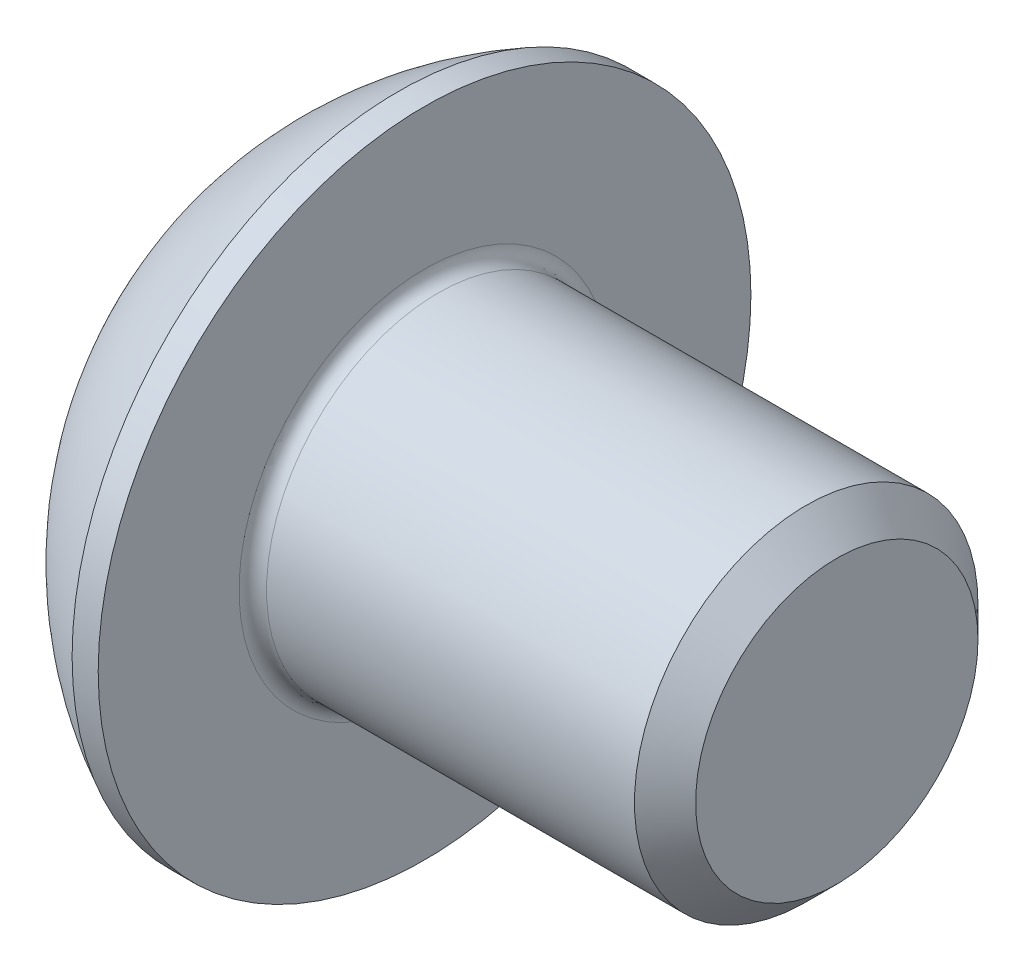
ISO-10303-21;
HEADER;
FILE_DESCRIPTION(('STEP AP214'),'2;1');
FILE_NAME('part.step','',(''),(''),'','','');
FILE_SCHEMA(('AUTOMOTIVE_DESIGN { 1 0 10303 214 1 1 1 1 }'));
ENDSEC;
DATA;
#1=APPLICATION_CONTEXT('core data for automotive mechanical design processes');
#2=APPLICATION_PROTOCOL_DEFINITION('international standard','automotive_design',2000,#1);
#3=PRODUCT_CONTEXT('',#1,'mechanical');
#4=PRODUCT('Part','Part','',(#3));
#5=PRODUCT_RELATED_PRODUCT_CATEGORY('part','',(#4));
#6=PRODUCT_DEFINITION_FORMATION('','',#4);
#7=PRODUCT_DEFINITION_CONTEXT('part definition',#1,'design');
#8=PRODUCT_DEFINITION('design','',#6,#7);
#9=PRODUCT_DEFINITION_SHAPE('','',#8);
#10=(LENGTH_UNIT() NAMED_UNIT(*) SI_UNIT(.MILLI.,.METRE.));
#11=(NAMED_UNIT(*) PLANE_ANGLE_UNIT() SI_UNIT($,.RADIAN.));
#12=(NAMED_UNIT(*) SI_UNIT($,.STERADIAN.) SOLID_ANGLE_UNIT());
#13=UNCERTAINTY_MEASURE_WITH_UNIT(LENGTH_MEASURE(1.E-05),#10,'distance_accuracy_value','');
#14=(GEOMETRIC_REPRESENTATION_CONTEXT(3) GLOBAL_UNCERTAINTY_ASSIGNED_CONTEXT((#13)) GLOBAL_UNIT_ASSIGNED_CONTEXT((#10,
#11,#12)) REPRESENTATION_CONTEXT('',''));
#15=CARTESIAN_POINT('',(0.,0.,0.));
#16=DIRECTION('',(0.,0.,1.));
#17=DIRECTION('',(1.,0.,0.));
#18=AXIS2_PLACEMENT_3D('',#15,#16,#17);
#19=CARTESIAN_POINT('',(4.75485015536767,-1.38777878078145E-13,-4.44089209850063E-13));
#20=DIRECTION('',(1.,0.,0.));
#21=DIRECTION('',(0.,0.999999999999994,0.));
#22=AXIS2_PLACEMENT_3D('',#19,#20,#21);
#23=SPHERICAL_SURFACE('',#22,5.315);
#24=CARTESIAN_POINT('',(0.,0.,0.));
#25=DIRECTION('',(1.,0.,0.));
#26=DIRECTION('',(0.,0.,-1.));
#27=AXIS2_PLACEMENT_3D('',#24,#25,#26);
#28=CIRCLE('',#27,2.375);
#29=CARTESIAN_POINT('',(0.,0.,-2.375));
#30=VERTEX_POINT('',#29);
#31=EDGE_CURVE('E190',#30,#30,#28,.T.);
#32=ORIENTED_EDGE('',*,*,#31,.T.);
#33=EDGE_LOOP('',(#32));
#34=FACE_BOUND('',#33,.T.);
#35=CARTESIAN_POINT('',(2.37016464151056,0.,0.));
#36=DIRECTION('',(1.,0.,0.));
#37=DIRECTION('',(0.,0.,-1.));
#38=AXIS2_PLACEMENT_3D('',#35,#36,#37);
#39=CIRCLE('',#38,4.75);
#40=CARTESIAN_POINT('',(2.37016464151061,0.,-4.75));
#41=VERTEX_POINT('',#40);
#42=EDGE_CURVE('E177',#41,#41,#39,.T.);
#43=ORIENTED_EDGE('',*,*,#42,.F.);
#44=EDGE_LOOP('',(#43));
#45=FACE_BOUND('',#44,.T.);
#46=ADVANCED_FACE('F34',(#34,#45),#23,.T.);
#47=CARTESIAN_POINT('',(-1.38777878078145E-13,2.37500000000004,-1.11022302462516E-13));
#48=DIRECTION('',(-1.,0.,0.));
#49=DIRECTION('',(0.,0.,1.));
#50=AXIS2_PLACEMENT_3D('',#47,#48,#49);
#51=PLANE('',#50);
#52=DIRECTION('',(0.,0.499999999999997,-0.86602540378444));
#53=VECTOR('',#52,1.);
#54=CARTESIAN_POINT('',(4.85722573273506E-13,0.866025403784443,1.5));
#55=LINE('',#54,#53);
#56=CARTESIAN_POINT('',(4.85722573273506E-13,0.866025403784443,1.5));
#57=VERTEX_POINT('',#56);
#58=CARTESIAN_POINT('',(-4.85722573273506E-13,1.73205080756889,0.));
#59=VERTEX_POINT('',#58);
#60=EDGE_CURVE('E156',#57,#59,#55,.T.);
#61=ORIENTED_EDGE('',*,*,#60,.F.);
#62=DIRECTION('',(0.,0.999999999999995,0.));
#63=VECTOR('',#62,1.);
#64=CARTESIAN_POINT('',(0.,-0.866025403784387,1.49999999999995));
#65=LINE('',#64,#63);
#66=CARTESIAN_POINT('',(0.,-0.866025403784387,1.49999999999995));
#67=VERTEX_POINT('',#66);
#68=EDGE_CURVE('E153',#67,#57,#65,.T.);
#69=ORIENTED_EDGE('',*,*,#68,.F.);
#70=DIRECTION('',(0.,0.499999999999998,0.866025403784441));
#71=VECTOR('',#70,1.);
#72=CARTESIAN_POINT('',(3.46944695195361E-13,-1.73205080756877,-2.22044604925031E-13));
#73=LINE('',#72,#71);
#74=CARTESIAN_POINT('',(3.46944695195361E-13,-1.73205080756877,-2.22044604925031E-13));
#75=VERTEX_POINT('',#74);
#76=EDGE_CURVE('E151',#75,#67,#73,.T.);
#77=ORIENTED_EDGE('',*,*,#76,.F.);
#78=DIRECTION('',(0.,-0.499999999999997,0.86602540378444));
#79=VECTOR('',#78,1.);
#80=CARTESIAN_POINT('',(0.,-0.866025403784415,-1.5));
#81=LINE('',#80,#79);
#82=CARTESIAN_POINT('',(0.,-0.866025403784415,-1.5));
#83=VERTEX_POINT('',#82);
#84=EDGE_CURVE('E149',#83,#75,#81,.T.);
#85=ORIENTED_EDGE('',*,*,#84,.F.);
#86=DIRECTION('',(0.,-0.999999999999994,0.));
#87=VECTOR('',#86,1.);
#88=CARTESIAN_POINT('',(0.,0.866025403784387,-1.49999999999995));
#89=LINE('',#88,#87);
#90=CARTESIAN_POINT('',(0.,0.866025403784387,-1.49999999999995));
#91=VERTEX_POINT('',#90);
#92=EDGE_CURVE('E123',#91,#83,#89,.T.);
#93=ORIENTED_EDGE('',*,*,#92,.F.);
#94=DIRECTION('',(0.,-0.499999999999997,-0.866025403784442));
#95=VECTOR('',#94,1.);
#96=CARTESIAN_POINT('',(-4.85722573273506E-13,1.73205080756889,0.));
#97=LINE('',#96,#95);
#98=EDGE_CURVE('E116',#59,#91,#97,.T.);
#99=ORIENTED_EDGE('',*,*,#98,.F.);
#100=EDGE_LOOP('',(#61,#69,#77,#85,#93,#99));
#101=FACE_BOUND('',#100,.T.);
#102=ORIENTED_EDGE('',*,*,#31,.F.);
#103=EDGE_LOOP('',(#102));
#104=FACE_BOUND('',#103,.T.);
#105=ADVANCED_FACE('F212',(#101,#104),#51,.T.);
#106=CARTESIAN_POINT('',(8.74999999999999,-4.9960036108132E-13,-1.16573417585641E-12));
#107=DIRECTION('',(1.,0.,0.));
#108=DIRECTION('',(0.,0.,-1.));
#109=AXIS2_PLACEMENT_3D('',#106,#107,#108);
#110=PLANE('',#109);
#111=CARTESIAN_POINT('',(8.74999999999999,-4.9960036108132E-13,-1.16573417585641E-12));
#112=DIRECTION('',(1.,0.,0.));
#113=DIRECTION('',(0.,0.,-1.));
#114=AXIS2_PLACEMENT_3D('',#111,#112,#113);
#115=CIRCLE('',#114,2.055);
#116=CARTESIAN_POINT('',(8.75000000000001,-4.99714436497101E-13,-2.05500000000117));
#117=VERTEX_POINT('',#116);
#118=EDGE_CURVE('E187',#117,#117,#115,.T.);
#119=ORIENTED_EDGE('',*,*,#118,.T.);
#120=EDGE_LOOP('',(#119));
#121=FACE_BOUND('',#120,.T.);
#122=ADVANCED_FACE('F217',(#121),#110,.T.);
#123=CARTESIAN_POINT('',(8.74999999999999,-4.9960036108132E-13,-1.16573417585641E-12));
#124=DIRECTION('',(-1.,0.,0.));
#125=DIRECTION('',(0.,0.,1.));
#126=AXIS2_PLACEMENT_3D('',#123,#124,#125);
#127=CONICAL_SURFACE('',#126,2.055,0.785398163397436);
#128=CARTESIAN_POINT('',(8.30499999999998,-1.11022302462516E-13,0.));
#129=DIRECTION('',(1.,0.,0.));
#130=DIRECTION('',(0.,0.,-1.));
#131=AXIS2_PLACEMENT_3D('',#128,#129,#130);
#132=CIRCLE('',#131,2.5);
#133=CARTESIAN_POINT('',(8.305,-1.11161080340594E-13,-2.5));
#134=VERTEX_POINT('',#133);
#135=EDGE_CURVE('E184',#134,#134,#132,.T.);
#136=ORIENTED_EDGE('',*,*,#135,.T.);
#137=EDGE_LOOP('',(#136));
#138=FACE_BOUND('',#137,.T.);
#139=ORIENTED_EDGE('',*,*,#118,.F.);
#140=EDGE_LOOP('',(#139));
#141=FACE_BOUND('',#140,.T.);
#142=ADVANCED_FACE('F224',(#138,#141),#127,.T.);
#143=CARTESIAN_POINT('',(-3.64348996551984,0.,-1.66533453693773E-13));
#144=DIRECTION('',(1.,0.,0.));
#145=DIRECTION('',(0.,0.,-1.));
#146=AXIS2_PLACEMENT_3D('',#143,#144,#145);
#147=CYLINDRICAL_SURFACE('',#146,2.5);
#148=CARTESIAN_POINT('',(2.94999999999999,0.,0.));
#149=DIRECTION('',(1.,0.,0.));
#150=DIRECTION('',(0.,0.,-1.));
#151=AXIS2_PLACEMENT_3D('',#148,#149,#150);
#152=CIRCLE('',#151,2.5);
#153=CARTESIAN_POINT('',(2.95000000000002,0.,-2.50000000000006));
#154=VERTEX_POINT('',#153);
#155=EDGE_CURVE('E42',#154,#154,#152,.T.);
#156=ORIENTED_EDGE('',*,*,#155,.T.);
#157=EDGE_LOOP('',(#156));
#158=FACE_BOUND('',#157,.T.);
#159=ORIENTED_EDGE('',*,*,#135,.F.);
#160=EDGE_LOOP('',(#159));
#161=FACE_BOUND('',#160,.T.);
#162=ADVANCED_FACE('F195',(#158,#161),#147,.T.);
#163=CARTESIAN_POINT('',(2.74999999999986,2.49999999999989,-2.22044604925031E-13));
#164=DIRECTION('',(1.,0.,0.));
#165=DIRECTION('',(0.,0.,-1.));
#166=AXIS2_PLACEMENT_3D('',#163,#164,#165);
#167=PLANE('',#166);
#168=CARTESIAN_POINT('',(2.75,0.,0.));
#169=DIRECTION('',(1.,0.,0.));
#170=DIRECTION('',(0.,0.,-1.));
#171=AXIS2_PLACEMENT_3D('',#168,#169,#170);
#172=CIRCLE('',#171,2.7);
#173=CARTESIAN_POINT('',(2.75000000000003,0.,-2.7));
#174=VERTEX_POINT('',#173);
#175=EDGE_CURVE('E11',#174,#174,#172,.F.);
#176=ORIENTED_EDGE('',*,*,#175,.T.);
#177=EDGE_LOOP('',(#176));
#178=FACE_BOUND('',#177,.T.);
#179=CARTESIAN_POINT('',(2.75,0.,0.));
#180=DIRECTION('',(1.,0.,0.));
#181=DIRECTION('',(0.,0.,-1.));
#182=AXIS2_PLACEMENT_3D('',#179,#180,#181);
#183=CIRCLE('',#182,4.75);
#184=CARTESIAN_POINT('',(2.75000000000005,0.,-4.75));
#185=VERTEX_POINT('',#184);
#186=EDGE_CURVE('E181',#185,#185,#183,.T.);
#187=ORIENTED_EDGE('',*,*,#186,.T.);
#188=EDGE_LOOP('',(#187));
#189=FACE_BOUND('',#188,.T.);
#190=ADVANCED_FACE('F207',(#178,#189),#167,.T.);
#191=CARTESIAN_POINT('',(-3.64348996551984,0.,-1.66533453693773E-13));
#192=DIRECTION('',(1.,0.,0.));
#193=DIRECTION('',(0.,0.,-1.));
#194=AXIS2_PLACEMENT_3D('',#191,#192,#193);
#195=CYLINDRICAL_SURFACE('',#194,4.75);
#196=ORIENTED_EDGE('',*,*,#42,.T.);
#197=EDGE_LOOP('',(#196));
#198=FACE_BOUND('',#197,.T.);
#199=ORIENTED_EDGE('',*,*,#186,.F.);
#200=EDGE_LOOP('',(#199));
#201=FACE_BOUND('',#200,.T.);
#202=ADVANCED_FACE('F199',(#198,#201),#195,.T.);
#203=CARTESIAN_POINT('',(2.94999999999999,0.,0.));
#204=DIRECTION('',(1.,0.,0.));
#205=DIRECTION('',(0.,0.,-1.));
#206=AXIS2_PLACEMENT_3D('',#203,#204,#205);
#207=TOROIDAL_SURFACE('',#206,2.7,0.2);
#208=ORIENTED_EDGE('',*,*,#175,.F.);
#209=EDGE_LOOP('',(#208));
#210=FACE_BOUND('',#209,.T.);
#211=ORIENTED_EDGE('',*,*,#155,.F.);
#212=EDGE_LOOP('',(#211));
#213=FACE_BOUND('',#212,.T.);
#214=ADVANCED_FACE('F36',(#210,#213),#207,.F.);
#215=CARTESIAN_POINT('',(1.55999999999999,0.866025403784387,-1.50000000000022));
#216=DIRECTION('',(0.,0.,-1.));
#217=DIRECTION('',(-1.,0.,0.));
#218=AXIS2_PLACEMENT_3D('',#215,#216,#217);
#219=PLANE('',#218);
#220=DIRECTION('',(0.,-0.999999999999994,0.));
#221=VECTOR('',#220,1.);
#222=CARTESIAN_POINT('',(1.55999999999999,0.866025403784387,-1.50000000000022));
#223=LINE('',#222,#221);
#224=CARTESIAN_POINT('',(1.55999999999999,0.866025403784387,-1.50000000000022));
#225=VERTEX_POINT('',#224);
#226=CARTESIAN_POINT('',(1.55999999999999,-1.94289029309402E-13,-1.50000000000045));
#227=VERTEX_POINT('',#226);
#228=EDGE_CURVE('E115',#225,#227,#223,.T.);
#229=ORIENTED_EDGE('',*,*,#228,.F.);
#230=DIRECTION('',(-1.,0.,0.));
#231=VECTOR('',#230,1.);
#232=CARTESIAN_POINT('',(1.55999999999999,0.866025403784387,-1.50000000000022));
#233=LINE('',#232,#231);
#234=EDGE_CURVE('E161',#225,#91,#233,.T.);
#235=ORIENTED_EDGE('',*,*,#234,.T.);
#236=ORIENTED_EDGE('',*,*,#92,.T.);
#237=DIRECTION('',(-1.,0.,0.));
#238=VECTOR('',#237,1.);
#239=CARTESIAN_POINT('',(1.56000000000001,-0.866025403784859,-1.50000000000095));
#240=LINE('',#239,#238);
#241=CARTESIAN_POINT('',(1.56000000000001,-0.866025403784859,-1.50000000000095));
#242=VERTEX_POINT('',#241);
#243=EDGE_CURVE('E120',#242,#83,#240,.T.);
#244=ORIENTED_EDGE('',*,*,#243,.F.);
#245=EDGE_CURVE('E105',#227,#242,#223,.T.);
#246=ORIENTED_EDGE('',*,*,#245,.F.);
#247=EDGE_LOOP('',(#229,#235,#236,#244,#246));
#248=FACE_BOUND('',#247,.T.);
#249=ADVANCED_FACE('F121',(#248),#219,.F.);
#250=CARTESIAN_POINT('',(1.55999999999952,1.73205080756869,-3.88578058618805E-13));
#251=DIRECTION('',(0.,0.866025403784435,-0.500000000000001));
#252=DIRECTION('',(0.,0.499999999999997,0.866025403784442));
#253=AXIS2_PLACEMENT_3D('',#250,#251,#252);
#254=PLANE('',#253);
#255=DIRECTION('',(0.,-0.499999999999997,-0.866025403784442));
#256=VECTOR('',#255,1.);
#257=CARTESIAN_POINT('',(1.55999999999952,1.73205080756869,-3.88578058618805E-13));
#258=LINE('',#257,#256);
#259=CARTESIAN_POINT('',(1.55999999999952,1.73205080756869,-3.88578058618805E-13));
#260=VERTEX_POINT('',#259);
#261=CARTESIAN_POINT('',(1.55999999999987,1.29903810567616,-0.750000000000806));
#262=VERTEX_POINT('',#261);
#263=EDGE_CURVE('E127',#260,#262,#258,.T.);
#264=ORIENTED_EDGE('',*,*,#263,.F.);
#265=DIRECTION('',(-1.,0.,0.));
#266=VECTOR('',#265,1.);
#267=CARTESIAN_POINT('',(1.55999999999952,1.73205080756869,-3.88578058618805E-13));
#268=LINE('',#267,#266);
#269=EDGE_CURVE('E164',#260,#59,#268,.T.);
#270=ORIENTED_EDGE('',*,*,#269,.T.);
#271=ORIENTED_EDGE('',*,*,#98,.T.);
#272=ORIENTED_EDGE('',*,*,#234,.F.);
#273=EDGE_CURVE('E145',#262,#225,#258,.T.);
#274=ORIENTED_EDGE('',*,*,#273,.F.);
#275=EDGE_LOOP('',(#264,#270,#271,#272,#274));
#276=FACE_BOUND('',#275,.T.);
#277=ADVANCED_FACE('F205',(#276),#254,.F.);
#278=CARTESIAN_POINT('',(1.56000000000048,0.866025403783804,1.49999999999878));
#279=DIRECTION('',(0.,0.866025403784434,0.500000000000002));
#280=DIRECTION('',(0.,-0.499999999999997,0.866025403784441));
#281=AXIS2_PLACEMENT_3D('',#278,#279,#280);
#282=PLANE('',#281);
#283=DIRECTION('',(0.,0.499999999999997,-0.86602540378444));
#284=VECTOR('',#283,1.);
#285=CARTESIAN_POINT('',(1.56000000000048,0.866025403783804,1.49999999999878));
#286=LINE('',#285,#284);
#287=CARTESIAN_POINT('',(1.56000000000048,0.866025403783804,1.49999999999878));
#288=VERTEX_POINT('',#287);
#289=CARTESIAN_POINT('',(1.56000000000034,1.29903810567647,0.749999999999695));
#290=VERTEX_POINT('',#289);
#291=EDGE_CURVE('E49',#288,#290,#286,.T.);
#292=ORIENTED_EDGE('',*,*,#291,.F.);
#293=DIRECTION('',(-1.,0.,0.));
#294=VECTOR('',#293,1.);
#295=CARTESIAN_POINT('',(1.56000000000048,0.866025403783804,1.49999999999878));
#296=LINE('',#295,#294);
#297=EDGE_CURVE('E167',#288,#57,#296,.T.);
#298=ORIENTED_EDGE('',*,*,#297,.T.);
#299=ORIENTED_EDGE('',*,*,#60,.T.);
#300=ORIENTED_EDGE('',*,*,#269,.F.);
#301=EDGE_CURVE('E143',#290,#260,#286,.T.);
#302=ORIENTED_EDGE('',*,*,#301,.F.);
#303=EDGE_LOOP('',(#292,#298,#299,#300,#302));
#304=FACE_BOUND('',#303,.T.);
#305=ADVANCED_FACE('F249',(#304),#282,.F.);
#306=CARTESIAN_POINT('',(1.56000000000001,-0.866025403785081,1.49999999999922));
#307=DIRECTION('',(0.,0.,1.));
#308=DIRECTION('',(0.,-0.999999999999996,0.));
#309=AXIS2_PLACEMENT_3D('',#306,#307,#308);
#310=PLANE('',#309);
#311=DIRECTION('',(0.,0.999999999999995,0.));
#312=VECTOR('',#311,1.);
#313=CARTESIAN_POINT('',(1.56000000000001,-0.866025403785081,1.49999999999922));
#314=LINE('',#313,#312);
#315=CARTESIAN_POINT('',(1.56000000000001,-0.866025403785081,1.49999999999922));
#316=VERTEX_POINT('',#315);
#317=CARTESIAN_POINT('',(1.55999999999952,-4.9960036108132E-13,1.49999999999895));
#318=VERTEX_POINT('',#317);
#319=EDGE_CURVE('E140',#316,#318,#314,.T.);
#320=ORIENTED_EDGE('',*,*,#319,.F.);
#321=DIRECTION('',(-1.,0.,0.));
#322=VECTOR('',#321,1.);
#323=CARTESIAN_POINT('',(1.56000000000001,-0.866025403785081,1.49999999999922));
#324=LINE('',#323,#322);
#325=EDGE_CURVE('E170',#316,#67,#324,.T.);
#326=ORIENTED_EDGE('',*,*,#325,.T.);
#327=ORIENTED_EDGE('',*,*,#68,.T.);
#328=ORIENTED_EDGE('',*,*,#297,.F.);
#329=EDGE_CURVE('E139',#318,#288,#314,.T.);
#330=ORIENTED_EDGE('',*,*,#329,.F.);
#331=EDGE_LOOP('',(#320,#326,#327,#328,#330));
#332=FACE_BOUND('',#331,.T.);
#333=ADVANCED_FACE('F245',(#332),#310,.F.);
#334=CARTESIAN_POINT('',(1.56000000000034,-1.73205080756914,-1.22124532708767E-12));
#335=DIRECTION('',(0.,-0.866025403784435,0.500000000000001));
#336=DIRECTION('',(0.,-0.499999999999998,-0.866025403784442));
#337=AXIS2_PLACEMENT_3D('',#334,#335,#336);
#338=PLANE('',#337);
#339=DIRECTION('',(0.,0.499999999999998,0.866025403784441));
#340=VECTOR('',#339,1.);
#341=CARTESIAN_POINT('',(1.56000000000034,-1.73205080756914,-1.22124532708767E-12));
#342=LINE('',#341,#340);
#343=CARTESIAN_POINT('',(1.56000000000034,-1.73205080756914,-1.22124532708767E-12));
#344=VERTEX_POINT('',#343);
#345=CARTESIAN_POINT('',(1.55999999999999,-1.29903810567669,0.749999999999973));
#346=VERTEX_POINT('',#345);
#347=EDGE_CURVE('E135',#344,#346,#342,.T.);
#348=ORIENTED_EDGE('',*,*,#347,.F.);
#349=DIRECTION('',(-1.,0.,0.));
#350=VECTOR('',#349,1.);
#351=CARTESIAN_POINT('',(1.56000000000034,-1.73205080756914,-1.22124532708767E-12));
#352=LINE('',#351,#350);
#353=EDGE_CURVE('E126',#344,#75,#352,.T.);
#354=ORIENTED_EDGE('',*,*,#353,.T.);
#355=ORIENTED_EDGE('',*,*,#76,.T.);
#356=ORIENTED_EDGE('',*,*,#325,.F.);
#357=EDGE_CURVE('E133',#346,#316,#342,.T.);
#358=ORIENTED_EDGE('',*,*,#357,.F.);
#359=EDGE_LOOP('',(#348,#354,#355,#356,#358));
#360=FACE_BOUND('',#359,.T.);
#361=ADVANCED_FACE('F242',(#360),#338,.F.);
#362=CARTESIAN_POINT('',(1.56000000000001,-0.866025403784859,-1.50000000000095));
#363=DIRECTION('',(0.,-0.866025403784433,-0.500000000000001));
#364=DIRECTION('',(0.,0.499999999999997,-0.86602540378444));
#365=AXIS2_PLACEMENT_3D('',#362,#363,#364);
#366=PLANE('',#365);
#367=DIRECTION('',(0.,-0.499999999999997,0.86602540378444));
#368=VECTOR('',#367,1.);
#369=CARTESIAN_POINT('',(1.56000000000001,-0.866025403784859,-1.50000000000095));
#370=LINE('',#369,#368);
#371=CARTESIAN_POINT('',(1.55999999999952,-1.29903810567678,-0.75000000000025));
#372=VERTEX_POINT('',#371);
#373=EDGE_CURVE('E109',#242,#372,#370,.T.);
#374=ORIENTED_EDGE('',*,*,#373,.F.);
#375=ORIENTED_EDGE('',*,*,#243,.T.);
#376=ORIENTED_EDGE('',*,*,#84,.T.);
#377=ORIENTED_EDGE('',*,*,#353,.F.);
#378=EDGE_CURVE('E132',#372,#344,#370,.T.);
#379=ORIENTED_EDGE('',*,*,#378,.F.);
#380=EDGE_LOOP('',(#374,#375,#376,#377,#379));
#381=FACE_BOUND('',#380,.T.);
#382=ADVANCED_FACE('F130',(#381),#366,.F.);
#383=CARTESIAN_POINT('',(1.56000000000001,-6.66133814775094E-13,-1.49880108324396E-12));
#384=DIRECTION('',(-1.,0.,0.));
#385=DIRECTION('',(0.,0.,1.));
#386=AXIS2_PLACEMENT_3D('',#383,#384,#385);
#387=PLANE('',#386);
#388=CARTESIAN_POINT('',(1.56000000000001,-6.66133814775094E-13,-1.49880108324396E-12));
#389=DIRECTION('',(1.,0.,0.));
#390=DIRECTION('',(0.,0.999999999999994,0.));
#391=AXIS2_PLACEMENT_3D('',#388,#389,#390);
#392=CIRCLE('',#391,1.5);
#393=EDGE_CURVE('E178',#318,#346,#392,.T.);
#394=ORIENTED_EDGE('',*,*,#393,.T.);
#395=ORIENTED_EDGE('',*,*,#357,.T.);
#396=ORIENTED_EDGE('',*,*,#319,.T.);
#397=EDGE_LOOP('',(#394,#395,#396));
#398=FACE_BOUND('',#397,.T.);
#399=ADVANCED_FACE('F241',(#398),#387,.T.);
#400=EDGE_CURVE('E280',#346,#372,#392,.T.);
#401=ORIENTED_EDGE('',*,*,#400,.T.);
#402=ORIENTED_EDGE('',*,*,#378,.T.);
#403=ORIENTED_EDGE('',*,*,#347,.T.);
#404=EDGE_LOOP('',(#401,#402,#403));
#405=FACE_BOUND('',#404,.T.);
#406=ADVANCED_FACE('F258',(#405),#387,.T.);
#407=EDGE_CURVE('E111',#372,#227,#392,.T.);
#408=ORIENTED_EDGE('',*,*,#407,.T.);
#409=ORIENTED_EDGE('',*,*,#245,.T.);
#410=ORIENTED_EDGE('',*,*,#373,.T.);
#411=EDGE_LOOP('',(#408,#409,#410));
#412=FACE_BOUND('',#411,.T.);
#413=ADVANCED_FACE('F107',(#412),#387,.T.);
#414=EDGE_CURVE('E281',#227,#262,#392,.T.);
#415=ORIENTED_EDGE('',*,*,#414,.T.);
#416=ORIENTED_EDGE('',*,*,#273,.T.);
#417=ORIENTED_EDGE('',*,*,#228,.T.);
#418=EDGE_LOOP('',(#415,#416,#417));
#419=FACE_BOUND('',#418,.T.);
#420=ADVANCED_FACE('F269',(#419),#387,.T.);
#421=EDGE_CURVE('E163',#262,#290,#392,.T.);
#422=ORIENTED_EDGE('',*,*,#421,.T.);
#423=ORIENTED_EDGE('',*,*,#301,.T.);
#424=ORIENTED_EDGE('',*,*,#263,.T.);
#425=EDGE_LOOP('',(#422,#423,#424));
#426=FACE_BOUND('',#425,.T.);
#427=ADVANCED_FACE('F265',(#426),#387,.T.);
#428=EDGE_CURVE('E175',#290,#318,#392,.T.);
#429=ORIENTED_EDGE('',*,*,#428,.T.);
#430=ORIENTED_EDGE('',*,*,#329,.T.);
#431=ORIENTED_EDGE('',*,*,#291,.T.);
#432=EDGE_LOOP('',(#429,#430,#431));
#433=FACE_BOUND('',#432,.T.);
#434=ADVANCED_FACE('F236',(#433),#387,.T.);
#435=CARTESIAN_POINT('',(2.42602540378445,-3.88578058618805E-13,-2.22044604925031E-13));
#436=DIRECTION('',(-1.,0.,0.));
#437=DIRECTION('',(0.,-0.999999999999994,0.));
#438=AXIS2_PLACEMENT_3D('',#435,#436,#437);
#439=CONICAL_SURFACE('',#438,0.,1.04719755119659);
#440=ORIENTED_EDGE('',*,*,#428,.F.);
#441=ORIENTED_EDGE('',*,*,#421,.F.);
#442=ORIENTED_EDGE('',*,*,#414,.F.);
#443=ORIENTED_EDGE('',*,*,#407,.F.);
#444=ORIENTED_EDGE('',*,*,#400,.F.);
#445=ORIENTED_EDGE('',*,*,#393,.F.);
#446=EDGE_LOOP('',(#440,#441,#442,#443,#444,#445));
#447=FACE_BOUND('',#446,.T.);
#448=CARTESIAN_POINT('',(2.42602540378445,-3.88578058618805E-13,-2.22044604925031E-13));
#449=VERTEX_POINT('',#448);
#450=VERTEX_LOOP('',#449);
#451=FACE_BOUND('',#450,.T.);
#452=ADVANCED_FACE('F234',(#447,#451),#439,.F.);
#453=CLOSED_SHELL('',(#46,#105,#122,#142,#162,#190,#202,#214,#249,#277,#305,#333,#361,#382,#399,
#406,#413,#420,#427,#434,#452));
#454=MANIFOLD_SOLID_BREP('B2',#453);
#455=ADVANCED_BREP_SHAPE_REPRESENTATION('',(#18,#454),#14);
#456=SHAPE_DEFINITION_REPRESENTATION(#9,#455);
ENDSEC;
END-ISO-10303-21;
